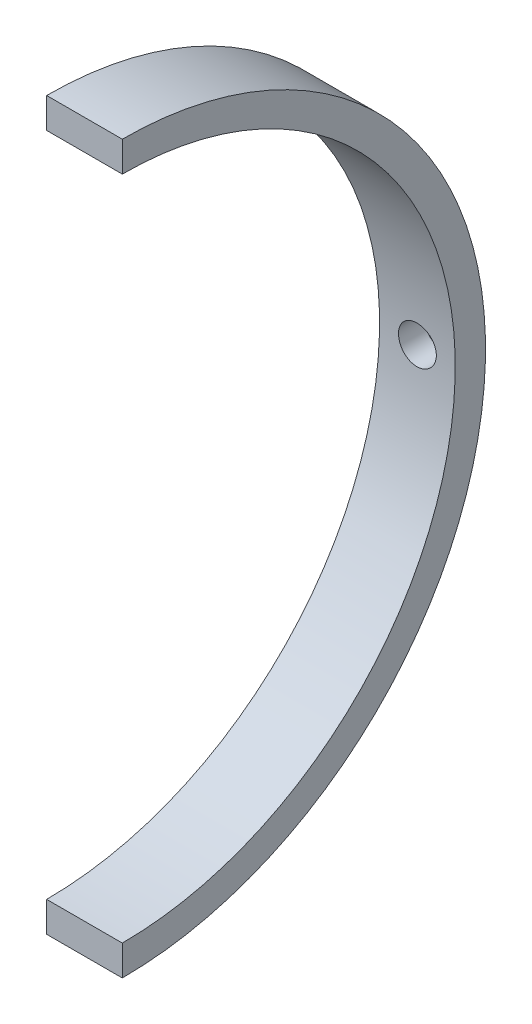
ISO-10303-21;
HEADER;
FILE_DESCRIPTION(('STEP AP214'),'2;1');
FILE_NAME('part.step','',(''),(''),'','','');
FILE_SCHEMA(('AUTOMOTIVE_DESIGN { 1 0 10303 214 1 1 1 1 }'));
ENDSEC;
DATA;
#1=APPLICATION_CONTEXT('core data for automotive mechanical design processes');
#2=APPLICATION_PROTOCOL_DEFINITION('international standard','automotive_design',2000,#1);
#3=PRODUCT_CONTEXT('',#1,'mechanical');
#4=PRODUCT('Part','Part','',(#3));
#5=PRODUCT_RELATED_PRODUCT_CATEGORY('part','',(#4));
#6=PRODUCT_DEFINITION_FORMATION('','',#4);
#7=PRODUCT_DEFINITION_CONTEXT('part definition',#1,'design');
#8=PRODUCT_DEFINITION('design','',#6,#7);
#9=PRODUCT_DEFINITION_SHAPE('','',#8);
#10=(LENGTH_UNIT() NAMED_UNIT(*) SI_UNIT(.MILLI.,.METRE.));
#11=(NAMED_UNIT(*) PLANE_ANGLE_UNIT() SI_UNIT($,.RADIAN.));
#12=(NAMED_UNIT(*) SI_UNIT($,.STERADIAN.) SOLID_ANGLE_UNIT());
#13=UNCERTAINTY_MEASURE_WITH_UNIT(LENGTH_MEASURE(1.E-05),#10,'distance_accuracy_value','');
#14=(GEOMETRIC_REPRESENTATION_CONTEXT(3) GLOBAL_UNCERTAINTY_ASSIGNED_CONTEXT((#13)) GLOBAL_UNIT_ASSIGNED_CONTEXT((#10,
#11,#12)) REPRESENTATION_CONTEXT('',''));
#15=CARTESIAN_POINT('',(0.,0.,0.));
#16=DIRECTION('',(0.,0.,1.));
#17=DIRECTION('',(1.,0.,0.));
#18=AXIS2_PLACEMENT_3D('',#15,#16,#17);
#19=CARTESIAN_POINT('',(-358.05,-23.9999999999999,1.6759110426447E-13));
#20=DIRECTION('',(-1.,0.,0.));
#21=DIRECTION('',(0.,0.,1.));
#22=AXIS2_PLACEMENT_3D('',#19,#20,#21);
#23=PLANE('',#22);
#24=CARTESIAN_POINT('',(-358.05,0.,0.));
#25=DIRECTION('',(1.,0.,0.));
#26=DIRECTION('',(0.,0.,-1.));
#27=AXIS2_PLACEMENT_3D('',#24,#25,#26);
#28=CIRCLE('',#27,23.9999999999999);
#29=CARTESIAN_POINT('',(-358.05,-23.9999999999999,1.6759110426447E-13));
#30=VERTEX_POINT('',#29);
#31=CARTESIAN_POINT('',(-358.05,23.9999999999999,0.));
#32=VERTEX_POINT('',#31);
#33=EDGE_CURVE('E53',#30,#32,#28,.T.);
#34=ORIENTED_EDGE('',*,*,#33,.F.);
#35=DIRECTION('',(0.,1.,0.));
#36=VECTOR('',#35,1.);
#37=CARTESIAN_POINT('',(-358.05,-23.9999999999999,1.6759110426447E-13));
#38=LINE('',#37,#36);
#39=CARTESIAN_POINT('',(-358.05,-21.9999999999999,1.53625178909097E-13));
#40=VERTEX_POINT('',#39);
#41=EDGE_CURVE('E88',#30,#40,#38,.T.);
#42=ORIENTED_EDGE('',*,*,#41,.T.);
#43=CARTESIAN_POINT('',(-358.05,0.,0.));
#44=DIRECTION('',(1.,0.,0.));
#45=DIRECTION('',(0.,0.,-1.));
#46=AXIS2_PLACEMENT_3D('',#43,#44,#45);
#47=CIRCLE('',#46,21.9999999999999);
#48=CARTESIAN_POINT('',(-358.05,21.9999999999999,0.));
#49=VERTEX_POINT('',#48);
#50=EDGE_CURVE('E83',#40,#49,#47,.T.);
#51=ORIENTED_EDGE('',*,*,#50,.T.);
#52=DIRECTION('',(0.,-1.,0.));
#53=VECTOR('',#52,1.);
#54=CARTESIAN_POINT('',(-358.05,23.9999999999999,0.));
#55=LINE('',#54,#53);
#56=EDGE_CURVE('E86',#32,#49,#55,.T.);
#57=ORIENTED_EDGE('',*,*,#56,.F.);
#58=EDGE_LOOP('',(#34,#42,#51,#57));
#59=FACE_BOUND('',#58,.T.);
#60=ADVANCED_FACE('F40',(#59),#23,.T.);
#61=CARTESIAN_POINT('',(-344.904513270691,0.,0.));
#62=DIRECTION('',(1.,0.,0.));
#63=DIRECTION('',(0.,0.,-1.));
#64=AXIS2_PLACEMENT_3D('',#61,#62,#63);
#65=CYLINDRICAL_SURFACE('',#64,23.9999999999999);
#66=CARTESIAN_POINT('',(-356.611770067695,-1.06167995267019,-23.9765059112061));
#67=CARTESIAN_POINT('',(-356.665904361429,-1.01073047354757,-23.9787618282585));
#68=CARTESIAN_POINT('',(-356.71626908511,-0.955757215186081,-23.9810330956299));
#69=CARTESIAN_POINT('',(-356.808239585294,-0.838864181940323,-23.9854065683903));
#70=CARTESIAN_POINT('',(-356.849840293096,-0.776940418762525,-23.987508675513));
#71=CARTESIAN_POINT('',(-356.927749234799,-0.639408394296681,-23.9915911229789));
#72=CARTESIAN_POINT('',(-356.962756928034,-0.563055895252525,-23.9935238518119));
#73=CARTESIAN_POINT('',(-357.019085683876,-0.405433782631594,-23.9967046092587));
#74=CARTESIAN_POINT('',(-357.04040521352,-0.324163619430832,-23.9979525611807));
#75=CARTESIAN_POINT('',(-357.068228411238,-0.161284728761434,-23.9995926314288));
#76=CARTESIAN_POINT('',(-357.07510138804,-0.0797392469030747,-24.0000060717397));
#77=CARTESIAN_POINT('',(-357.074896370808,0.0833245763534567,-23.999993794364));
#78=CARTESIAN_POINT('',(-357.067820455906,0.164842919985286,-23.9995682017381));
#79=CARTESIAN_POINT('',(-357.040139076601,0.324513762227381,-23.9979372632096));
#80=CARTESIAN_POINT('',(-357.019698669169,0.402695084289088,-23.9967414327069));
#81=CARTESIAN_POINT('',(-356.966130866291,0.554565076666673,-23.9937123366229));
#82=CARTESIAN_POINT('',(-356.933002955963,0.628253564514541,-23.9918790451725));
#83=CARTESIAN_POINT('',(-356.854708143264,0.769917321951611,-23.9877532882937));
#84=CARTESIAN_POINT('',(-356.809419076158,0.837824857475987,-23.9854562256276));
#85=CARTESIAN_POINT('',(-356.708359697031,0.965318520858113,-23.98066383804));
#86=CARTESIAN_POINT('',(-356.65258814217,1.02490366052136,-23.9781684896293));
#87=CARTESIAN_POINT('',(-356.53057839043,1.13576634401797,-23.9731767221748));
#88=CARTESIAN_POINT('',(-356.464101643296,1.18678135857024,-23.9706820332351));
#89=CARTESIAN_POINT('',(-356.32371838159,1.27730225588152,-23.9660292843709));
#90=CARTESIAN_POINT('',(-356.249810786775,1.31680646201875,-23.9638712735069));
#91=CARTESIAN_POINT('',(-356.094364440437,1.38436566519904,-23.9600650261379));
#92=CARTESIAN_POINT('',(-356.012666663075,1.41205591052073,-23.958433364947));
#93=CARTESIAN_POINT('',(-355.845820848415,1.45364508610108,-23.9559460821965));
#94=CARTESIAN_POINT('',(-355.76067240657,1.4675423944153,-23.955090551905));
#95=CARTESIAN_POINT('',(-355.587560433438,1.48135944203281,-23.9542402521536));
#96=CARTESIAN_POINT('',(-355.499574428643,1.48100011561521,-23.9542626678922));
#97=CARTESIAN_POINT('',(-355.324894221613,1.46561714032464,-23.9552087000357));
#98=CARTESIAN_POINT('',(-355.238200091766,1.45059267283994,-23.9561323667485));
#99=CARTESIAN_POINT('',(-355.068179932438,1.40613452972123,-23.9587829485232));
#100=CARTESIAN_POINT('',(-354.984870675651,1.37663679661456,-23.9605134327821));
#101=CARTESIAN_POINT('',(-354.824478738579,1.30392340980644,-23.9645801715855));
#102=CARTESIAN_POINT('',(-354.747395858794,1.26070819584599,-23.9669164067109));
#103=CARTESIAN_POINT('',(-354.602687057522,1.16225694420813,-23.9718908425968));
#104=CARTESIAN_POINT('',(-354.534958895494,1.10717113395592,-23.9745250900814));
#105=CARTESIAN_POINT('',(-354.410023606579,0.98613203048093,-23.9798082059936));
#106=CARTESIAN_POINT('',(-354.352815018363,0.920180249123729,-23.9824570723377));
#107=CARTESIAN_POINT('',(-354.252161115474,0.78108515804443,-23.9873844926236));
#108=CARTESIAN_POINT('',(-354.208397478276,0.70817257582356,-23.9896708657305));
#109=CARTESIAN_POINT('',(-354.13416276184,0.55585316022552,-23.9936829035357));
#110=CARTESIAN_POINT('',(-354.103689109302,0.476447587606046,-23.9954086767648));
#111=CARTESIAN_POINT('',(-354.057819391715,0.315963736910823,-23.9980501522211));
#112=CARTESIAN_POINT('',(-354.04199817704,0.235007225676885,-23.9989886166227));
#113=CARTESIAN_POINT('',(-354.024434097093,0.071579047598304,-24.0000322573345));
#114=CARTESIAN_POINT('',(-354.022689387109,-0.0108924192932166,-24.0001375428319));
#115=CARTESIAN_POINT('',(-354.033236572081,-0.173384566462929,-23.9995087489959));
#116=CARTESIAN_POINT('',(-354.045268729772,-0.253422331998293,-23.9987902011758));
#117=CARTESIAN_POINT('',(-354.082537600602,-0.41034628136854,-23.9966201130262));
#118=CARTESIAN_POINT('',(-354.107774220046,-0.487232487561566,-23.9951685778978));
#119=CARTESIAN_POINT('',(-354.170729362235,-0.636000500146063,-23.9916874116821));
#120=CARTESIAN_POINT('',(-354.208490331276,-0.707864268221214,-23.9896558180211));
#121=CARTESIAN_POINT('',(-354.295278683717,-0.844413747531881,-23.9852379595172));
#122=CARTESIAN_POINT('',(-354.344307177568,-0.909098750344648,-23.982851659725));
#123=CARTESIAN_POINT('',(-354.453402118311,-1.03106034577715,-23.9779217378373));
#124=CARTESIAN_POINT('',(-354.513694676903,-1.08813447922526,-23.9753757696548));
#125=CARTESIAN_POINT('',(-354.642771682467,-1.19170266312017,-23.9704513961195));
#126=CARTESIAN_POINT('',(-354.711557368385,-1.23819516713961,-23.9680730152933));
#127=CARTESIAN_POINT('',(-354.857861556088,-1.32073287863725,-23.9636689636511));
#128=CARTESIAN_POINT('',(-354.935578865969,-1.35642645347374,-23.9616558788853));
#129=CARTESIAN_POINT('',(-355.095817896902,-1.41461535896094,-23.9582911920611));
#130=CARTESIAN_POINT('',(-355.178340129237,-1.43710928223011,-23.9569396605418));
#131=CARTESIAN_POINT('',(-355.347917591698,-1.46875275109889,-23.9550209149488));
#132=CARTESIAN_POINT('',(-355.435033704365,-1.47757780154447,-23.954472789235));
#133=CARTESIAN_POINT('',(-355.609541857515,-1.4806583827454,-23.9542825554806));
#134=CARTESIAN_POINT('',(-355.696933956338,-1.47491059390325,-23.9546406538719));
#135=CARTESIAN_POINT('',(-355.870390434064,-1.44884898587927,-23.9562310759297));
#136=CARTESIAN_POINT('',(-355.956433330492,-1.4283926026327,-23.9574719547514));
#137=CARTESIAN_POINT('',(-356.123778722692,-1.37325046289017,-23.9606957499029));
#138=CARTESIAN_POINT('',(-356.205084594356,-1.33857498502972,-23.9626781301288));
#139=CARTESIAN_POINT('',(-356.342546721319,-1.26547518336293,-23.9666346167874));
#140=CARTESIAN_POINT('',(-356.400170788416,-1.22977223018489,-23.9685046199311));
#141=CARTESIAN_POINT('',(-356.510158472118,-1.15104765375066,-23.9724141935481));
#142=CARTESIAN_POINT('',(-356.562524035588,-1.10802875509533,-23.9744537007507));
#143=CARTESIAN_POINT('',(-356.611770067695,-1.06167995267019,-23.9765059112061));
#144=B_SPLINE_CURVE_WITH_KNOTS('',3,(#66,#67,#68,#69,#70,#71,#72,#73,#74,#75,#76,#77,#78,#79,
#80,#81,#82,#83,#84,#85,#86,#87,#88,#89,#90,#91,#92,#93,#94,#95,#96,#97,#98,#99,#100,#101,#102,
#103,#104,#105,#106,#107,#108,#109,#110,#111,#112,#113,#114,#115,#116,#117,#118,#119,#120,#121,
#122,#123,#124,#125,#126,#127,#128,#129,#130,#131,#132,#133,#134,#135,#136,#137,#138,#139,#140,
#141,#142,#143),.UNSPECIFIED.,.T.,.F.,(4,2,2,2,2,2,2,2,2,2,2,2,2,2,2,2,2,2,2,2,2,2,2,2,2,2,2,2,
2,2,2,2,2,2,2,2,2,2,4),(0.,0.222931167950525,0.445990917167471,0.696776063552825,
0.947589290961341,1.19190866421469,1.43619162356564,1.67751317063651,1.91884451200862,
2.16269723243536,2.4065788831649,2.65693476040915,2.90732708535657,3.16497170480484,
3.42264661771169,3.68536781716684,3.94810368262175,4.21201302978677,4.47591391766963,
4.73665295573507,4.99735574577594,5.25130078487499,5.50519663148766,5.75147084450638,
5.99771278302897,6.23938766319453,6.48106082854638,6.72356156385882,6.96608620865433,
7.21413857883215,7.46222717679678,7.71769034182731,7.97318074006503,8.23464819293644,
8.4961752117347,8.76027187199638,9.02417795884849,9.22705410064751,9.42985485220927),.UNSPECIFIED.);
#145=CARTESIAN_POINT('',(-356.611770067695,-1.06167995267019,-23.9765059112061));
#146=VERTEX_POINT('',#145);
#147=EDGE_CURVE('E11',#146,#146,#144,.T.);
#148=ORIENTED_EDGE('',*,*,#147,.F.);
#149=EDGE_LOOP('',(#148));
#150=FACE_BOUND('',#149,.T.);
#151=CARTESIAN_POINT('',(-353.05,0.,0.));
#152=DIRECTION('',(1.,0.,0.));
#153=DIRECTION('',(0.,0.,-1.));
#154=AXIS2_PLACEMENT_3D('',#151,#152,#153);
#155=CIRCLE('',#154,23.9999999999999);
#156=CARTESIAN_POINT('',(-353.05,-23.9999999999999,1.6759110426447E-13));
#157=VERTEX_POINT('',#156);
#158=CARTESIAN_POINT('',(-353.05,23.9999999999999,0.));
#159=VERTEX_POINT('',#158);
#160=EDGE_CURVE('E66',#157,#159,#155,.T.);
#161=ORIENTED_EDGE('',*,*,#160,.F.);
#162=DIRECTION('',(-1.,0.,0.));
#163=VECTOR('',#162,1.);
#164=CARTESIAN_POINT('',(-353.05,-23.9999999999999,1.6759110426447E-13));
#165=LINE('',#164,#163);
#166=EDGE_CURVE('E93',#157,#30,#165,.T.);
#167=ORIENTED_EDGE('',*,*,#166,.T.);
#168=ORIENTED_EDGE('',*,*,#33,.T.);
#169=DIRECTION('',(-1.,0.,0.));
#170=VECTOR('',#169,1.);
#171=CARTESIAN_POINT('',(-353.05,23.9999999999999,0.));
#172=LINE('',#171,#170);
#173=EDGE_CURVE('E105',#159,#32,#172,.T.);
#174=ORIENTED_EDGE('',*,*,#173,.F.);
#175=EDGE_LOOP('',(#161,#167,#168,#174));
#176=FACE_BOUND('',#175,.T.);
#177=ADVANCED_FACE('F42',(#150,#176),#65,.T.);
#178=CARTESIAN_POINT('',(-353.05,-23.9999999999999,1.6759110426447E-13));
#179=DIRECTION('',(1.,0.,0.));
#180=DIRECTION('',(0.,0.,-1.));
#181=AXIS2_PLACEMENT_3D('',#178,#179,#180);
#182=PLANE('',#181);
#183=CARTESIAN_POINT('',(-353.05,0.,0.));
#184=DIRECTION('',(1.,0.,0.));
#185=DIRECTION('',(0.,0.,-1.));
#186=AXIS2_PLACEMENT_3D('',#183,#184,#185);
#187=CIRCLE('',#186,21.9999999999999);
#188=CARTESIAN_POINT('',(-353.05,-21.9999999999999,1.53625178909097E-13));
#189=VERTEX_POINT('',#188);
#190=CARTESIAN_POINT('',(-353.05,21.9999999999999,0.));
#191=VERTEX_POINT('',#190);
#192=EDGE_CURVE('E92',#189,#191,#187,.T.);
#193=ORIENTED_EDGE('',*,*,#192,.F.);
#194=DIRECTION('',(0.,-1.,0.));
#195=VECTOR('',#194,1.);
#196=CARTESIAN_POINT('',(-353.05,-23.9999999999999,1.6759110426447E-13));
#197=LINE('',#196,#195);
#198=EDGE_CURVE('E123',#189,#157,#197,.T.);
#199=ORIENTED_EDGE('',*,*,#198,.T.);
#200=ORIENTED_EDGE('',*,*,#160,.T.);
#201=DIRECTION('',(0.,1.,0.));
#202=VECTOR('',#201,1.);
#203=CARTESIAN_POINT('',(-353.05,23.9999999999999,0.));
#204=LINE('',#203,#202);
#205=EDGE_CURVE('E101',#191,#159,#204,.T.);
#206=ORIENTED_EDGE('',*,*,#205,.F.);
#207=EDGE_LOOP('',(#193,#199,#200,#206));
#208=FACE_BOUND('',#207,.T.);
#209=ADVANCED_FACE('F132',(#208),#182,.T.);
#210=CARTESIAN_POINT('',(-344.904513270691,0.,0.));
#211=DIRECTION('',(1.,0.,0.));
#212=DIRECTION('',(0.,0.,-1.));
#213=AXIS2_PLACEMENT_3D('',#210,#211,#212);
#214=CYLINDRICAL_SURFACE('',#213,21.9999999999999);
#215=CARTESIAN_POINT('',(-356.8,0.,-21.9999999999999));
#216=CARTESIAN_POINT('',(-356.799996908713,-0.0701523245045099,-21.9999995264541));
#217=CARTESIAN_POINT('',(-356.79407454181,-0.140354072875401,-21.9996608625002));
#218=CARTESIAN_POINT('',(-356.770533561773,-0.278820013638146,-21.9983424230828));
#219=CARTESIAN_POINT('',(-356.752901254499,-0.347081839816466,-21.9973618970156));
#220=CARTESIAN_POINT('',(-356.706447691944,-0.479642148257127,-21.9948706838394));
#221=CARTESIAN_POINT('',(-356.677632242574,-0.543942667057558,-21.9933602718683));
#222=CARTESIAN_POINT('',(-356.609639538823,-0.666777017332372,-21.9899792766856));
#223=CARTESIAN_POINT('',(-356.570464692631,-0.725312184710218,-21.988108777209));
#224=CARTESIAN_POINT('',(-356.482810673001,-0.835045258782135,-21.9842152990127));
#225=CARTESIAN_POINT('',(-356.434321220045,-0.886234949010358,-21.9821921533461));
#226=CARTESIAN_POINT('',(-356.329435351471,-0.979753815894466,-21.9782228348638));
#227=CARTESIAN_POINT('',(-356.273038609213,-1.02208262633954,-21.9762766652321));
#228=CARTESIAN_POINT('',(-356.153893881522,-1.09670244229367,-21.9726795207874));
#229=CARTESIAN_POINT('',(-356.09114171603,-1.12898678382276,-21.971028742258));
#230=CARTESIAN_POINT('',(-355.96109680106,-1.18255854486359,-21.9682106480542));
#231=CARTESIAN_POINT('',(-355.893804093477,-1.20384606582975,-21.9670433279195));
#232=CARTESIAN_POINT('',(-355.756666051519,-1.23479753776549,-21.9653253467752));
#233=CARTESIAN_POINT('',(-355.686823579844,-1.24447413479437,-21.964774014906));
#234=CARTESIAN_POINT('',(-355.546503624972,-1.25196810496551,-21.9643481724523));
#235=CARTESIAN_POINT('',(-355.476026147921,-1.2497855927777,-21.9644736553234));
#236=CARTESIAN_POINT('',(-355.336522845157,-1.23363380899064,-21.9653866685887));
#237=CARTESIAN_POINT('',(-355.267495430536,-1.21967821137253,-21.9661734309286));
#238=CARTESIAN_POINT('',(-355.132764565069,-1.18039760539871,-21.9683191242466));
#239=CARTESIAN_POINT('',(-355.067061131317,-1.15507253858357,-21.9696780581666));
#240=CARTESIAN_POINT('',(-354.94079931479,-1.09375631140553,-21.9728158264351));
#241=CARTESIAN_POINT('',(-354.880243957961,-1.05775893306716,-21.9745949054482));
#242=CARTESIAN_POINT('',(-354.766030326819,-0.97612443254403,-21.9783722123666));
#243=CARTESIAN_POINT('',(-354.712372116145,-0.930487221424597,-21.9803704422936));
#244=CARTESIAN_POINT('',(-354.613396365655,-0.830791441803128,-21.9843642601758));
#245=CARTESIAN_POINT('',(-354.568090748144,-0.776721035939856,-21.9863598403792));
#246=CARTESIAN_POINT('',(-354.487198161409,-0.661735274345575,-21.9901207310101));
#247=CARTESIAN_POINT('',(-354.451611195063,-0.600819916588115,-21.9918860413695));
#248=CARTESIAN_POINT('',(-354.39116716705,-0.473866306202156,-21.9949875634022));
#249=CARTESIAN_POINT('',(-354.366310539824,-0.407827846281286,-21.9963237577013));
#250=CARTESIAN_POINT('',(-354.328040659751,-0.272505784384206,-21.9984162250695));
#251=CARTESIAN_POINT('',(-354.314627296396,-0.203222213752798,-21.9991725037389));
#252=CARTESIAN_POINT('',(-354.299639435159,-0.0634801065873239,-22.0000191920759));
#253=CARTESIAN_POINT('',(-354.298048450179,0.00697665627542052,-22.0001105290457));
#254=CARTESIAN_POINT('',(-354.306707454914,0.147156100884854,-21.9996195052759));
#255=CARTESIAN_POINT('',(-354.316957393847,0.216878785778443,-21.9990371474255));
#256=CARTESIAN_POINT('',(-354.34899363962,0.35356457734192,-21.9972649059043));
#257=CARTESIAN_POINT('',(-354.370772399651,0.42052945840918,-21.9960754196802));
#258=CARTESIAN_POINT('',(-354.425240410739,0.549853471219071,-21.9932227898962));
#259=CARTESIAN_POINT('',(-354.457929742968,0.612212568691526,-21.9915596428125));
#260=CARTESIAN_POINT('',(-354.533333055064,0.730630467200753,-21.9879443629971));
#261=CARTESIAN_POINT('',(-354.576058065854,0.786682234405411,-21.9859919131503));
#262=CARTESIAN_POINT('',(-354.670303843756,0.890823601607467,-21.9820188921319));
#263=CARTESIAN_POINT('',(-354.721824682884,0.938913136406315,-21.9799983204026));
#264=CARTESIAN_POINT('',(-354.832270663075,1.02582063866545,-21.9761141238164));
#265=CARTESIAN_POINT('',(-354.891204216971,1.06462792397654,-21.9742506813671));
#266=CARTESIAN_POINT('',(-355.01476033075,1.13179629249471,-21.9708937679003));
#267=CARTESIAN_POINT('',(-355.079382860504,1.16015743101949,-21.9694002949237));
#268=CARTESIAN_POINT('',(-355.212443243603,1.20560987702841,-21.9669530476091));
#269=CARTESIAN_POINT('',(-355.280878779895,1.22270794946526,-21.9659989493546));
#270=CARTESIAN_POINT('',(-355.41965484164,1.24517102092149,-21.9647371404901));
#271=CARTESIAN_POINT('',(-355.489995352089,1.25053611232193,-21.9644294247907));
#272=CARTESIAN_POINT('',(-355.630478390974,1.2493800533813,-21.9644952054001));
#273=CARTESIAN_POINT('',(-355.700621058718,1.24287570146408,-21.9648677389755));
#274=CARTESIAN_POINT('',(-355.838816714361,1.21820016969298,-21.9662499973528));
#275=CARTESIAN_POINT('',(-355.906869698373,1.20002896813573,-21.96725972334));
#276=CARTESIAN_POINT('',(-356.038957175297,1.15253918173309,-21.9698023438967));
#277=CARTESIAN_POINT('',(-356.102991665983,1.12322059070847,-21.9713352387563));
#278=CARTESIAN_POINT('',(-356.225231116722,1.05427080905606,-21.9747514039971));
#279=CARTESIAN_POINT('',(-356.28343624112,1.01463990927026,-21.9766346644964));
#280=CARTESIAN_POINT('',(-356.392449436884,0.926129097802087,-21.980542401941));
#281=CARTESIAN_POINT('',(-356.443247773495,0.877237204881801,-21.9825670596501));
#282=CARTESIAN_POINT('',(-356.535932460175,0.771605313159611,-21.9865279770669));
#283=CARTESIAN_POINT('',(-356.577816621007,0.7148633920989,-21.9884642149682));
#284=CARTESIAN_POINT('',(-356.65150940105,0.595087256763204,-21.9920317951568));
#285=CARTESIAN_POINT('',(-356.683306867033,0.53204617782379,-21.9936627991245));
#286=CARTESIAN_POINT('',(-356.735827564503,0.40155732896433,-21.9964313646145));
#287=CARTESIAN_POINT('',(-356.756563819148,0.334114846649914,-21.9975695061205));
#288=CARTESIAN_POINT('',(-356.780959995847,0.221880534040149,-21.9989245063157));
#289=CARTESIAN_POINT('',(-356.788090821323,0.177814909121068,-21.9993260336785));
#290=CARTESIAN_POINT('',(-356.797611803316,0.0891728468915207,-21.9998639308903));
#291=CARTESIAN_POINT('',(-356.800001965156,0.0445964101546673,-22.0000003010369));
#292=CARTESIAN_POINT('',(-356.8,0.,-21.9999999999999));
#293=B_SPLINE_CURVE_WITH_KNOTS('',3,(#215,#216,#217,#218,#219,#220,#221,#222,#223,#224,#225,
#226,#227,#228,#229,#230,#231,#232,#233,#234,#235,#236,#237,#238,#239,#240,#241,#242,#243,#244,
#245,#246,#247,#248,#249,#250,#251,#252,#253,#254,#255,#256,#257,#258,#259,#260,#261,#262,#263,
#264,#265,#266,#267,#268,#269,#270,#271,#272,#273,#274,#275,#276,#277,#278,#279,#280,#281,#282,
#283,#284,#285,#286,#287,#288,#289,#290,#291,#292),.UNSPECIFIED.,.T.,.F.,(4,2,2,2,2,2,2,2,2,2,2,
2,2,2,2,2,2,2,2,2,2,2,2,2,2,2,2,2,2,2,2,2,2,2,2,2,2,2,4),(0.,0.210294174909755,
0.420834711542655,0.63126608853605,0.841648590688797,1.05226461700503,1.26288934614164,
1.47365351725322,1.68441574386297,1.89494820943072,2.10547863928887,2.31576488235342,
2.52605220667824,2.73646229163023,2.9468743178573,3.15758439470643,3.36829453393653,
3.57901320342963,3.78972983799267,4.00015255883712,4.21057437725806,4.42085862280875,
4.63114443286023,4.8416624735904,5.05218223805726,5.26294311851801,5.47370288287589,
5.68433594256843,5.89496734380992,6.10530087667537,6.31563480081702,6.5259688415513,
6.73629695079693,6.94689904998238,7.15755281148752,7.36843869516128,7.57907573664604,
7.71276162480476,7.84644736285625),.UNSPECIFIED.);
#294=CARTESIAN_POINT('',(-356.8,0.,-21.9999999999999));
#295=VERTEX_POINT('',#294);
#296=EDGE_CURVE('E106',#295,#295,#293,.T.);
#297=ORIENTED_EDGE('',*,*,#296,.F.);
#298=EDGE_LOOP('',(#297));
#299=FACE_BOUND('',#298,.T.);
#300=DIRECTION('',(1.,0.,0.));
#301=VECTOR('',#300,1.);
#302=CARTESIAN_POINT('',(-353.05,-21.9999999999999,1.53625178909097E-13));
#303=LINE('',#302,#301);
#304=EDGE_CURVE('E121',#40,#189,#303,.T.);
#305=ORIENTED_EDGE('',*,*,#304,.T.);
#306=ORIENTED_EDGE('',*,*,#192,.T.);
#307=DIRECTION('',(1.,0.,0.));
#308=VECTOR('',#307,1.);
#309=CARTESIAN_POINT('',(-353.05,21.9999999999999,0.));
#310=LINE('',#309,#308);
#311=EDGE_CURVE('E96',#49,#191,#310,.T.);
#312=ORIENTED_EDGE('',*,*,#311,.F.);
#313=ORIENTED_EDGE('',*,*,#50,.F.);
#314=EDGE_LOOP('',(#305,#306,#312,#313));
#315=FACE_BOUND('',#314,.T.);
#316=ADVANCED_FACE('F97',(#299,#315),#214,.F.);
#317=CARTESIAN_POINT('',(0.,0.,0.));
#318=DIRECTION('',(0.,0.,1.));
#319=DIRECTION('',(-1.,0.,0.));
#320=AXIS2_PLACEMENT_3D('',#317,#318,#319);
#321=PLANE('',#320);
#322=ORIENTED_EDGE('',*,*,#41,.F.);
#323=ORIENTED_EDGE('',*,*,#166,.F.);
#324=ORIENTED_EDGE('',*,*,#198,.F.);
#325=ORIENTED_EDGE('',*,*,#304,.F.);
#326=EDGE_LOOP('',(#322,#323,#324,#325));
#327=FACE_BOUND('',#326,.T.);
#328=ADVANCED_FACE('F130',(#327),#321,.T.);
#329=CARTESIAN_POINT('',(0.,0.,0.));
#330=DIRECTION('',(0.,0.,-1.));
#331=DIRECTION('',(-1.,0.,0.));
#332=AXIS2_PLACEMENT_3D('',#329,#330,#331);
#333=PLANE('',#332);
#334=ORIENTED_EDGE('',*,*,#56,.T.);
#335=ORIENTED_EDGE('',*,*,#311,.T.);
#336=ORIENTED_EDGE('',*,*,#205,.T.);
#337=ORIENTED_EDGE('',*,*,#173,.T.);
#338=EDGE_LOOP('',(#334,#335,#336,#337));
#339=FACE_BOUND('',#338,.T.);
#340=ADVANCED_FACE('F104',(#339),#333,.F.);
#341=CARTESIAN_POINT('',(-355.55,0.,-23.9999999999999));
#342=DIRECTION('',(0.,0.,-1.));
#343=DIRECTION('',(-1.,0.,0.));
#344=AXIS2_PLACEMENT_3D('',#341,#342,#343);
#345=CYLINDRICAL_SURFACE('',#344,1.24999999999997);
#346=CARTESIAN_POINT('',(-355.55,0.,-23.7249999999999));
#347=DIRECTION('',(0.,0.,-1.));
#348=DIRECTION('',(-1.,0.,0.));
#349=AXIS2_PLACEMENT_3D('',#346,#347,#348);
#350=CIRCLE('',#349,1.24999999999997);
#351=CARTESIAN_POINT('',(-356.8,0.,-23.7249999999999));
#352=VERTEX_POINT('',#351);
#353=EDGE_CURVE('E109',#352,#352,#350,.T.);
#354=ORIENTED_EDGE('',*,*,#353,.T.);
#355=EDGE_LOOP('',(#354));
#356=FACE_BOUND('',#355,.T.);
#357=ORIENTED_EDGE('',*,*,#296,.T.);
#358=EDGE_LOOP('',(#357));
#359=FACE_BOUND('',#358,.T.);
#360=ADVANCED_FACE('F149',(#356,#359),#345,.F.);
#361=CARTESIAN_POINT('',(-355.55,0.,-23.9999999999999));
#362=DIRECTION('',(0.,0.,-1.));
#363=DIRECTION('',(-1.,0.,0.));
#364=AXIS2_PLACEMENT_3D('',#361,#362,#363);
#365=CONICAL_SURFACE('',#364,1.525,0.785398163397492);
#366=ORIENTED_EDGE('',*,*,#147,.T.);
#367=EDGE_LOOP('',(#366));
#368=FACE_BOUND('',#367,.T.);
#369=ORIENTED_EDGE('',*,*,#353,.F.);
#370=EDGE_LOOP('',(#369));
#371=FACE_BOUND('',#370,.T.);
#372=ADVANCED_FACE('F153',(#368,#371),#365,.F.);
#373=CLOSED_SHELL('',(#60,#177,#209,#316,#328,#340,#360,#372));
#374=MANIFOLD_SOLID_BREP('B2',#373);
#375=ADVANCED_BREP_SHAPE_REPRESENTATION('',(#18,#374),#14);
#376=SHAPE_DEFINITION_REPRESENTATION(#9,#375);
ENDSEC;
END-ISO-10303-21;
